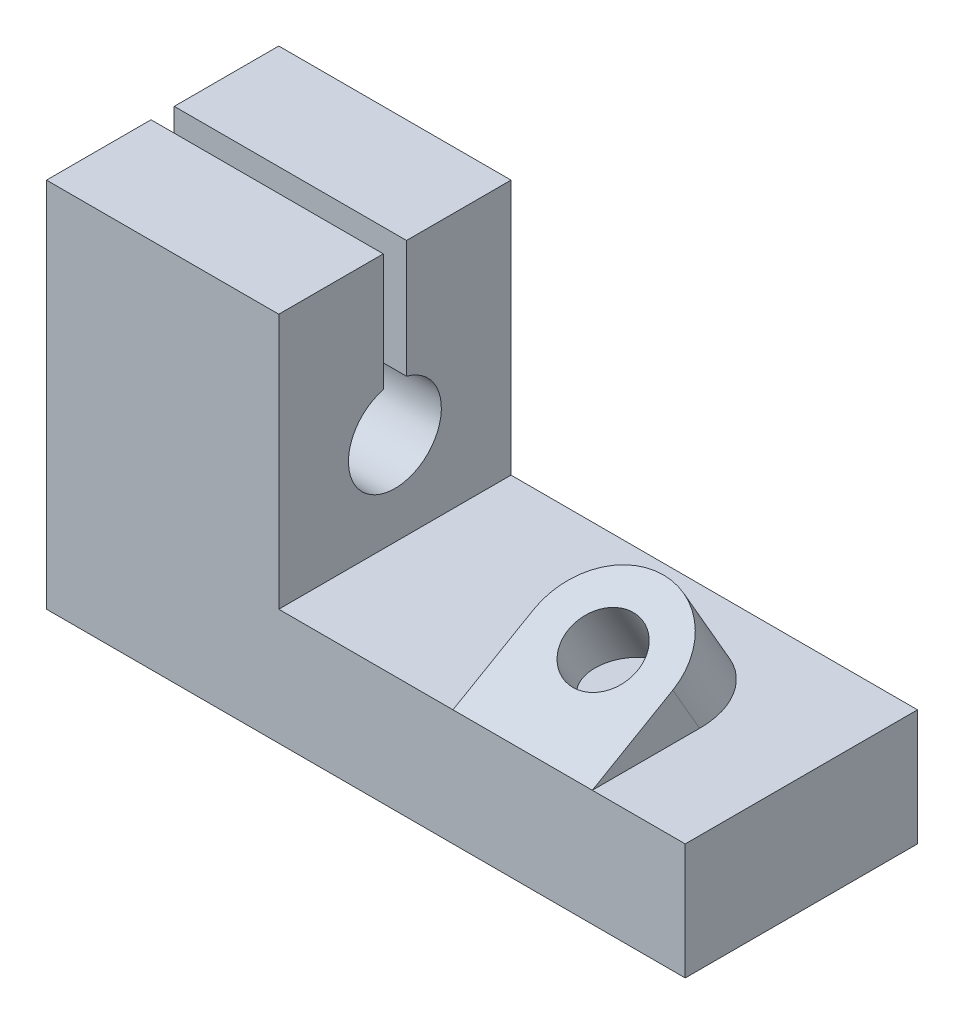
ISO-10303-21;
HEADER;
FILE_DESCRIPTION(('STEP AP214'),'2;1');
FILE_NAME('part.step','',(''),(''),'','','');
FILE_SCHEMA(('AUTOMOTIVE_DESIGN { 1 0 10303 214 1 1 1 1 }'));
ENDSEC;
DATA;
#1=APPLICATION_CONTEXT('core data for automotive mechanical design processes');
#2=APPLICATION_PROTOCOL_DEFINITION('international standard','automotive_design',2000,#1);
#3=PRODUCT_CONTEXT('',#1,'mechanical');
#4=PRODUCT('Part','Part','',(#3));
#5=PRODUCT_RELATED_PRODUCT_CATEGORY('part','',(#4));
#6=PRODUCT_DEFINITION_FORMATION('','',#4);
#7=PRODUCT_DEFINITION_CONTEXT('part definition',#1,'design');
#8=PRODUCT_DEFINITION('design','',#6,#7);
#9=PRODUCT_DEFINITION_SHAPE('','',#8);
#10=(LENGTH_UNIT() NAMED_UNIT(*) SI_UNIT(.MILLI.,.METRE.));
#11=(NAMED_UNIT(*) PLANE_ANGLE_UNIT() SI_UNIT($,.RADIAN.));
#12=(NAMED_UNIT(*) SI_UNIT($,.STERADIAN.) SOLID_ANGLE_UNIT());
#13=UNCERTAINTY_MEASURE_WITH_UNIT(LENGTH_MEASURE(1.E-05),#10,'distance_accuracy_value','');
#14=(GEOMETRIC_REPRESENTATION_CONTEXT(3) GLOBAL_UNCERTAINTY_ASSIGNED_CONTEXT((#13)) GLOBAL_UNIT_ASSIGNED_CONTEXT((#10,
#11,#12)) REPRESENTATION_CONTEXT('',''));
#15=CARTESIAN_POINT('',(0.,0.,0.));
#16=DIRECTION('',(0.,0.,1.));
#17=DIRECTION('',(1.,0.,0.));
#18=AXIS2_PLACEMENT_3D('',#15,#16,#17);
#19=CARTESIAN_POINT('',(0.,32.,10.));
#20=DIRECTION('',(0.,-1.,0.));
#21=DIRECTION('',(0.,0.,-1.));
#22=AXIS2_PLACEMENT_3D('',#19,#20,#21);
#23=PLANE('',#22);
#24=DIRECTION('',(0.,0.,-1.));
#25=VECTOR('',#24,1.);
#26=CARTESIAN_POINT('',(20.,32.,10.));
#27=LINE('',#26,#25);
#28=CARTESIAN_POINT('',(20.,32.,10.));
#29=VERTEX_POINT('',#28);
#30=CARTESIAN_POINT('',(20.,32.,1.));
#31=VERTEX_POINT('',#30);
#32=EDGE_CURVE('E240',#29,#31,#27,.T.);
#33=ORIENTED_EDGE('',*,*,#32,.T.);
#34=DIRECTION('',(1.,0.,0.));
#35=VECTOR('',#34,1.);
#36=CARTESIAN_POINT('',(0.,32.,1.));
#37=LINE('',#36,#35);
#38=CARTESIAN_POINT('',(0.,32.,1.));
#39=VERTEX_POINT('',#38);
#40=EDGE_CURVE('E202',#39,#31,#37,.T.);
#41=ORIENTED_EDGE('',*,*,#40,.F.);
#42=DIRECTION('',(0.,0.,-1.));
#43=VECTOR('',#42,1.);
#44=CARTESIAN_POINT('',(0.,32.,10.));
#45=LINE('',#44,#43);
#46=CARTESIAN_POINT('',(0.,32.,10.));
#47=VERTEX_POINT('',#46);
#48=EDGE_CURVE('E236',#47,#39,#45,.T.);
#49=ORIENTED_EDGE('',*,*,#48,.F.);
#50=DIRECTION('',(-1.,0.,0.));
#51=VECTOR('',#50,1.);
#52=CARTESIAN_POINT('',(0.,32.,10.));
#53=LINE('',#52,#51);
#54=EDGE_CURVE('E220',#29,#47,#53,.T.);
#55=ORIENTED_EDGE('',*,*,#54,.F.);
#56=EDGE_LOOP('',(#33,#41,#49,#55));
#57=FACE_BOUND('',#56,.T.);
#58=ADVANCED_FACE('F51',(#57),#23,.F.);
#59=CARTESIAN_POINT('',(0.,0.,10.));
#60=DIRECTION('',(1.,0.,0.));
#61=DIRECTION('',(0.,0.,-1.));
#62=AXIS2_PLACEMENT_3D('',#59,#60,#61);
#63=PLANE('',#62);
#64=ORIENTED_EDGE('',*,*,#48,.T.);
#65=DIRECTION('',(0.,-1.,0.));
#66=VECTOR('',#65,1.);
#67=CARTESIAN_POINT('',(0.,32.,1.));
#68=LINE('',#67,#66);
#69=CARTESIAN_POINT('',(0.,21.8729833462074,0.999999999999999));
#70=VERTEX_POINT('',#69);
#71=EDGE_CURVE('E190',#39,#70,#68,.T.);
#72=ORIENTED_EDGE('',*,*,#71,.T.);
#73=CARTESIAN_POINT('',(0.,18.,0.));
#74=DIRECTION('',(1.,0.,0.));
#75=DIRECTION('',(0.,1.,0.));
#76=AXIS2_PLACEMENT_3D('',#73,#74,#75);
#77=CIRCLE('',#76,4.);
#78=CARTESIAN_POINT('',(0.,21.8729833462074,-0.999999999999999));
#79=VERTEX_POINT('',#78);
#80=EDGE_CURVE('E183',#70,#79,#77,.T.);
#81=ORIENTED_EDGE('',*,*,#80,.T.);
#82=DIRECTION('',(0.,1.,0.));
#83=VECTOR('',#82,1.);
#84=CARTESIAN_POINT('',(0.,32.,-1.));
#85=LINE('',#84,#83);
#86=CARTESIAN_POINT('',(0.,32.,-1.));
#87=VERTEX_POINT('',#86);
#88=EDGE_CURVE('E186',#79,#87,#85,.T.);
#89=ORIENTED_EDGE('',*,*,#88,.T.);
#90=CARTESIAN_POINT('',(0.,32.,-10.));
#91=VERTEX_POINT('',#90);
#92=EDGE_CURVE('E222',#87,#91,#45,.T.);
#93=ORIENTED_EDGE('',*,*,#92,.T.);
#94=DIRECTION('',(0.,-1.,0.));
#95=VECTOR('',#94,1.);
#96=CARTESIAN_POINT('',(0.,0.,-10.));
#97=LINE('',#96,#95);
#98=CARTESIAN_POINT('',(0.,0.,-10.));
#99=VERTEX_POINT('',#98);
#100=EDGE_CURVE('E201',#91,#99,#97,.T.);
#101=ORIENTED_EDGE('',*,*,#100,.T.);
#102=DIRECTION('',(0.,0.,-1.));
#103=VECTOR('',#102,1.);
#104=CARTESIAN_POINT('',(0.,0.,10.));
#105=LINE('',#104,#103);
#106=CARTESIAN_POINT('',(0.,0.,10.));
#107=VERTEX_POINT('',#106);
#108=EDGE_CURVE('E59',#107,#99,#105,.T.);
#109=ORIENTED_EDGE('',*,*,#108,.F.);
#110=DIRECTION('',(0.,-1.,0.));
#111=VECTOR('',#110,1.);
#112=CARTESIAN_POINT('',(0.,0.,10.));
#113=LINE('',#112,#111);
#114=EDGE_CURVE('E207',#47,#107,#113,.T.);
#115=ORIENTED_EDGE('',*,*,#114,.F.);
#116=EDGE_LOOP('',(#64,#72,#81,#89,#93,#101,#109,#115));
#117=FACE_BOUND('',#116,.T.);
#118=ADVANCED_FACE('F53',(#117),#63,.F.);
#119=CARTESIAN_POINT('',(0.,0.,10.));
#120=DIRECTION('',(0.,1.,0.));
#121=DIRECTION('',(0.,0.,1.));
#122=AXIS2_PLACEMENT_3D('',#119,#120,#121);
#123=PLANE('',#122);
#124=DIRECTION('',(1.,0.,0.));
#125=VECTOR('',#124,1.);
#126=CARTESIAN_POINT('',(0.,0.,-10.));
#127=LINE('',#126,#125);
#128=CARTESIAN_POINT('',(55.,0.,-10.));
#129=VERTEX_POINT('',#128);
#130=EDGE_CURVE('E225',#99,#129,#127,.T.);
#131=ORIENTED_EDGE('',*,*,#130,.T.);
#132=DIRECTION('',(0.,0.,-1.));
#133=VECTOR('',#132,1.);
#134=CARTESIAN_POINT('',(55.,0.,10.));
#135=LINE('',#134,#133);
#136=CARTESIAN_POINT('',(55.,0.,10.));
#137=VERTEX_POINT('',#136);
#138=EDGE_CURVE('E249',#137,#129,#135,.T.);
#139=ORIENTED_EDGE('',*,*,#138,.F.);
#140=DIRECTION('',(1.,0.,0.));
#141=VECTOR('',#140,1.);
#142=CARTESIAN_POINT('',(0.,0.,10.));
#143=LINE('',#142,#141);
#144=EDGE_CURVE('E210',#107,#137,#143,.T.);
#145=ORIENTED_EDGE('',*,*,#144,.F.);
#146=ORIENTED_EDGE('',*,*,#108,.T.);
#147=EDGE_LOOP('',(#131,#139,#145,#146));
#148=FACE_BOUND('',#147,.T.);
#149=ADVANCED_FACE('F254',(#148),#123,.F.);
#150=CARTESIAN_POINT('',(55.,10.,10.));
#151=DIRECTION('',(-1.,0.,0.));
#152=DIRECTION('',(0.,0.,1.));
#153=AXIS2_PLACEMENT_3D('',#150,#151,#152);
#154=PLANE('',#153);
#155=DIRECTION('',(0.,1.,0.));
#156=VECTOR('',#155,1.);
#157=CARTESIAN_POINT('',(55.,10.,-10.));
#158=LINE('',#157,#156);
#159=CARTESIAN_POINT('',(55.,10.,-10.));
#160=VERTEX_POINT('',#159);
#161=EDGE_CURVE('E227',#129,#160,#158,.T.);
#162=ORIENTED_EDGE('',*,*,#161,.T.);
#163=DIRECTION('',(0.,0.,-1.));
#164=VECTOR('',#163,1.);
#165=CARTESIAN_POINT('',(55.,10.,10.));
#166=LINE('',#165,#164);
#167=CARTESIAN_POINT('',(55.,10.,10.));
#168=VERTEX_POINT('',#167);
#169=EDGE_CURVE('E246',#168,#160,#166,.T.);
#170=ORIENTED_EDGE('',*,*,#169,.F.);
#171=DIRECTION('',(0.,1.,0.));
#172=VECTOR('',#171,1.);
#173=CARTESIAN_POINT('',(55.,10.,10.));
#174=LINE('',#173,#172);
#175=EDGE_CURVE('E213',#137,#168,#174,.T.);
#176=ORIENTED_EDGE('',*,*,#175,.F.);
#177=ORIENTED_EDGE('',*,*,#138,.T.);
#178=EDGE_LOOP('',(#162,#170,#176,#177));
#179=FACE_BOUND('',#178,.T.);
#180=ADVANCED_FACE('F268',(#179),#154,.F.);
#181=CARTESIAN_POINT('',(20.,10.,10.));
#182=DIRECTION('',(0.,-1.,0.));
#183=DIRECTION('',(0.,0.,-1.));
#184=AXIS2_PLACEMENT_3D('',#181,#182,#183);
#185=PLANE('',#184);
#186=DIRECTION('',(-1.,0.,0.));
#187=VECTOR('',#186,1.);
#188=CARTESIAN_POINT('',(20.,10.,10.));
#189=LINE('',#188,#187);
#190=CARTESIAN_POINT('',(35.,10.,10.));
#191=VERTEX_POINT('',#190);
#192=CARTESIAN_POINT('',(20.,10.,10.));
#193=VERTEX_POINT('',#192);
#194=EDGE_CURVE('E215',#191,#193,#189,.T.);
#195=ORIENTED_EDGE('',*,*,#194,.F.);
#196=DIRECTION('',(0.,0.,1.));
#197=VECTOR('',#196,1.);
#198=CARTESIAN_POINT('',(35.,9.99999999999091,-288673.217498582));
#199=LINE('',#198,#197);
#200=CARTESIAN_POINT('',(35.,9.99999999996248,0.762395692959217));
#201=VERTEX_POINT('',#200);
#202=EDGE_CURVE('E165',#201,#191,#199,.T.);
#203=ORIENTED_EDGE('',*,*,#202,.F.);
#204=CARTESIAN_POINT('',(41.,9.99999999993406,0.762395692959217));
#205=DIRECTION('',(0.,-1.,0.));
#206=DIRECTION('',(0.,0.,1.));
#207=AXIS2_PLACEMENT_3D('',#204,#205,#206);
#208=ELLIPSE('',#207,6.92820323027551,6.);
#209=CARTESIAN_POINT('',(47.,9.99999999993406,0.762395692959217));
#210=VERTEX_POINT('',#209);
#211=EDGE_CURVE('E158',#210,#201,#208,.F.);
#212=ORIENTED_EDGE('',*,*,#211,.F.);
#213=DIRECTION('',(0.,0.,-1.));
#214=VECTOR('',#213,1.);
#215=CARTESIAN_POINT('',(47.,9.99999999999091,-288673.217498582));
#216=LINE('',#215,#214);
#217=CARTESIAN_POINT('',(47.,10.,10.));
#218=VERTEX_POINT('',#217);
#219=EDGE_CURVE('E147',#218,#210,#216,.T.);
#220=ORIENTED_EDGE('',*,*,#219,.F.);
#221=EDGE_CURVE('E216',#168,#218,#189,.T.);
#222=ORIENTED_EDGE('',*,*,#221,.F.);
#223=ORIENTED_EDGE('',*,*,#169,.T.);
#224=DIRECTION('',(-1.,0.,0.));
#225=VECTOR('',#224,1.);
#226=CARTESIAN_POINT('',(20.,10.,-10.));
#227=LINE('',#226,#225);
#228=CARTESIAN_POINT('',(20.,10.,-10.));
#229=VERTEX_POINT('',#228);
#230=EDGE_CURVE('E229',#160,#229,#227,.T.);
#231=ORIENTED_EDGE('',*,*,#230,.T.);
#232=DIRECTION('',(0.,0.,-1.));
#233=VECTOR('',#232,1.);
#234=CARTESIAN_POINT('',(20.,10.,10.));
#235=LINE('',#234,#233);
#236=EDGE_CURVE('E243',#193,#229,#235,.T.);
#237=ORIENTED_EDGE('',*,*,#236,.F.);
#238=EDGE_LOOP('',(#195,#203,#212,#220,#222,#223,#231,#237));
#239=FACE_BOUND('',#238,.T.);
#240=ADVANCED_FACE('F169',(#239),#185,.F.);
#241=CARTESIAN_POINT('',(20.,32.,10.));
#242=DIRECTION('',(-1.,0.,0.));
#243=DIRECTION('',(0.,-1.,0.));
#244=AXIS2_PLACEMENT_3D('',#241,#242,#243);
#245=PLANE('',#244);
#246=CARTESIAN_POINT('',(20.,18.,0.));
#247=DIRECTION('',(1.,0.,0.));
#248=DIRECTION('',(0.,1.,0.));
#249=AXIS2_PLACEMENT_3D('',#246,#247,#248);
#250=CIRCLE('',#249,4.);
#251=CARTESIAN_POINT('',(20.,21.8729833462074,0.999999999999999));
#252=VERTEX_POINT('',#251);
#253=CARTESIAN_POINT('',(20.,21.8729833462074,-0.999999999999999));
#254=VERTEX_POINT('',#253);
#255=EDGE_CURVE('E178',#252,#254,#250,.T.);
#256=ORIENTED_EDGE('',*,*,#255,.F.);
#257=DIRECTION('',(0.,-1.,0.));
#258=VECTOR('',#257,1.);
#259=CARTESIAN_POINT('',(20.,32.,1.));
#260=LINE('',#259,#258);
#261=EDGE_CURVE('E187',#31,#252,#260,.T.);
#262=ORIENTED_EDGE('',*,*,#261,.F.);
#263=ORIENTED_EDGE('',*,*,#32,.F.);
#264=DIRECTION('',(0.,1.,0.));
#265=VECTOR('',#264,1.);
#266=CARTESIAN_POINT('',(20.,32.,10.));
#267=LINE('',#266,#265);
#268=EDGE_CURVE('E218',#193,#29,#267,.T.);
#269=ORIENTED_EDGE('',*,*,#268,.F.);
#270=ORIENTED_EDGE('',*,*,#236,.T.);
#271=DIRECTION('',(0.,1.,0.));
#272=VECTOR('',#271,1.);
#273=CARTESIAN_POINT('',(20.,32.,-10.));
#274=LINE('',#273,#272);
#275=CARTESIAN_POINT('',(20.,32.,-10.));
#276=VERTEX_POINT('',#275);
#277=EDGE_CURVE('E231',#229,#276,#274,.T.);
#278=ORIENTED_EDGE('',*,*,#277,.T.);
#279=CARTESIAN_POINT('',(20.,32.,-0.999999999999999));
#280=VERTEX_POINT('',#279);
#281=EDGE_CURVE('E239',#280,#276,#27,.T.);
#282=ORIENTED_EDGE('',*,*,#281,.F.);
#283=DIRECTION('',(0.,1.,0.));
#284=VECTOR('',#283,1.);
#285=CARTESIAN_POINT('',(20.,32.,-1.));
#286=LINE('',#285,#284);
#287=EDGE_CURVE('E74',#254,#280,#286,.T.);
#288=ORIENTED_EDGE('',*,*,#287,.F.);
#289=EDGE_LOOP('',(#256,#262,#263,#269,#270,#278,#282,#288));
#290=FACE_BOUND('',#289,.T.);
#291=ADVANCED_FACE('F284',(#290),#245,.F.);
#292=ORIENTED_EDGE('',*,*,#92,.F.);
#293=DIRECTION('',(1.,0.,0.));
#294=VECTOR('',#293,1.);
#295=CARTESIAN_POINT('',(0.,32.,-1.));
#296=LINE('',#295,#294);
#297=EDGE_CURVE('E204',#87,#280,#296,.T.);
#298=ORIENTED_EDGE('',*,*,#297,.T.);
#299=ORIENTED_EDGE('',*,*,#281,.T.);
#300=DIRECTION('',(-1.,0.,0.));
#301=VECTOR('',#300,1.);
#302=CARTESIAN_POINT('',(0.,32.,-10.));
#303=LINE('',#302,#301);
#304=EDGE_CURVE('E211',#276,#91,#303,.T.);
#305=ORIENTED_EDGE('',*,*,#304,.T.);
#306=EDGE_LOOP('',(#292,#298,#299,#305));
#307=FACE_BOUND('',#306,.T.);
#308=ADVANCED_FACE('F292',(#307),#23,.F.);
#309=CARTESIAN_POINT('',(0.,0.,10.));
#310=DIRECTION('',(0.,0.,-1.));
#311=DIRECTION('',(-1.,0.,0.));
#312=AXIS2_PLACEMENT_3D('',#309,#310,#311);
#313=PLANE('',#312);
#314=ORIENTED_EDGE('',*,*,#114,.T.);
#315=ORIENTED_EDGE('',*,*,#144,.T.);
#316=ORIENTED_EDGE('',*,*,#175,.T.);
#317=ORIENTED_EDGE('',*,*,#221,.T.);
#318=DIRECTION('',(1.,0.,0.));
#319=VECTOR('',#318,1.);
#320=CARTESIAN_POINT('',(47.,10.,10.));
#321=LINE('',#320,#319);
#322=EDGE_CURVE('E174',#191,#218,#321,.T.);
#323=ORIENTED_EDGE('',*,*,#322,.F.);
#324=ORIENTED_EDGE('',*,*,#194,.T.);
#325=ORIENTED_EDGE('',*,*,#268,.T.);
#326=ORIENTED_EDGE('',*,*,#54,.T.);
#327=EDGE_LOOP('',(#314,#315,#316,#317,#323,#324,#325,#326));
#328=FACE_BOUND('',#327,.T.);
#329=ADVANCED_FACE('F273',(#328),#313,.F.);
#330=CARTESIAN_POINT('',(0.,0.,-10.));
#331=DIRECTION('',(0.,0.,-1.));
#332=DIRECTION('',(-1.,0.,0.));
#333=AXIS2_PLACEMENT_3D('',#330,#331,#332);
#334=PLANE('',#333);
#335=ORIENTED_EDGE('',*,*,#100,.F.);
#336=ORIENTED_EDGE('',*,*,#304,.F.);
#337=ORIENTED_EDGE('',*,*,#277,.F.);
#338=ORIENTED_EDGE('',*,*,#230,.F.);
#339=ORIENTED_EDGE('',*,*,#161,.F.);
#340=ORIENTED_EDGE('',*,*,#130,.F.);
#341=EDGE_LOOP('',(#335,#336,#337,#338,#339,#340));
#342=FACE_BOUND('',#341,.T.);
#343=ADVANCED_FACE('F262',(#342),#334,.T.);
#344=CARTESIAN_POINT('',(0.,18.,0.));
#345=DIRECTION('',(1.,0.,0.));
#346=DIRECTION('',(0.,1.,0.));
#347=AXIS2_PLACEMENT_3D('',#344,#345,#346);
#348=CYLINDRICAL_SURFACE('',#347,4.);
#349=ORIENTED_EDGE('',*,*,#255,.T.);
#350=DIRECTION('',(1.,0.,0.));
#351=VECTOR('',#350,1.);
#352=CARTESIAN_POINT('',(0.,21.8729833462074,-0.999999999999999));
#353=LINE('',#352,#351);
#354=EDGE_CURVE('E193',#79,#254,#353,.T.);
#355=ORIENTED_EDGE('',*,*,#354,.F.);
#356=ORIENTED_EDGE('',*,*,#80,.F.);
#357=DIRECTION('',(1.,0.,0.));
#358=VECTOR('',#357,1.);
#359=CARTESIAN_POINT('',(0.,21.8729833462074,0.999999999999999));
#360=LINE('',#359,#358);
#361=EDGE_CURVE('E199',#70,#252,#360,.T.);
#362=ORIENTED_EDGE('',*,*,#361,.T.);
#363=EDGE_LOOP('',(#349,#355,#356,#362));
#364=FACE_BOUND('',#363,.T.);
#365=ADVANCED_FACE('F288',(#364),#348,.F.);
#366=CARTESIAN_POINT('',(0.,32.,1.));
#367=DIRECTION('',(0.,0.,1.));
#368=DIRECTION('',(0.,-1.,0.));
#369=AXIS2_PLACEMENT_3D('',#366,#367,#368);
#370=PLANE('',#369);
#371=ORIENTED_EDGE('',*,*,#261,.T.);
#372=ORIENTED_EDGE('',*,*,#361,.F.);
#373=ORIENTED_EDGE('',*,*,#71,.F.);
#374=ORIENTED_EDGE('',*,*,#40,.T.);
#375=EDGE_LOOP('',(#371,#372,#373,#374));
#376=FACE_BOUND('',#375,.T.);
#377=ADVANCED_FACE('F281',(#376),#370,.F.);
#378=CARTESIAN_POINT('',(0.,32.,-1.));
#379=DIRECTION('',(0.,0.,-1.));
#380=DIRECTION('',(0.,1.,0.));
#381=AXIS2_PLACEMENT_3D('',#378,#379,#380);
#382=PLANE('',#381);
#383=ORIENTED_EDGE('',*,*,#287,.T.);
#384=ORIENTED_EDGE('',*,*,#297,.F.);
#385=ORIENTED_EDGE('',*,*,#88,.F.);
#386=ORIENTED_EDGE('',*,*,#354,.T.);
#387=EDGE_LOOP('',(#383,#384,#385,#386));
#388=FACE_BOUND('',#387,.T.);
#389=ADVANCED_FACE('F293',(#388),#382,.F.);
#390=CARTESIAN_POINT('',(35.,-500004.,-288673.217498582));
#391=DIRECTION('',(-1.,0.,0.));
#392=DIRECTION('',(0.,0.,1.));
#393=AXIS2_PLACEMENT_3D('',#390,#391,#392);
#394=PLANE('',#393);
#395=DIRECTION('',(0.,0.866025403784438,0.500000000000001));
#396=VECTOR('',#395,1.);
#397=CARTESIAN_POINT('',(35.,-500000.,-288680.145701813));
#398=LINE('',#397,#396);
#399=CARTESIAN_POINT('',(35.,14.,3.0717967697245));
#400=VERTEX_POINT('',#399);
#401=EDGE_CURVE('E164',#201,#400,#398,.T.);
#402=ORIENTED_EDGE('',*,*,#401,.F.);
#403=ORIENTED_EDGE('',*,*,#202,.T.);
#404=DIRECTION('',(0.,-0.500000000000001,0.866025403784438));
#405=VECTOR('',#404,1.);
#406=CARTESIAN_POINT('',(35.,10.,10.));
#407=LINE('',#406,#405);
#408=EDGE_CURVE('E66',#400,#191,#407,.T.);
#409=ORIENTED_EDGE('',*,*,#408,.F.);
#410=EDGE_LOOP('',(#402,#403,#409));
#411=FACE_BOUND('',#410,.T.);
#412=ADVANCED_FACE('F295',(#411),#394,.T.);
#413=CARTESIAN_POINT('',(41.,-500000.,-288680.145701813));
#414=DIRECTION('',(0.,0.866025403784438,0.500000000000001));
#415=DIRECTION('',(0.,-0.500000000000001,0.866025403784438));
#416=AXIS2_PLACEMENT_3D('',#413,#414,#415);
#417=CYLINDRICAL_SURFACE('',#416,6.);
#418=DIRECTION('',(0.,0.866025403784438,0.500000000000001));
#419=VECTOR('',#418,1.);
#420=CARTESIAN_POINT('',(47.,-500000.,-288680.145701813));
#421=LINE('',#420,#419);
#422=CARTESIAN_POINT('',(47.,14.,3.07179676972449));
#423=VERTEX_POINT('',#422);
#424=EDGE_CURVE('E150',#210,#423,#421,.T.);
#425=ORIENTED_EDGE('',*,*,#424,.F.);
#426=ORIENTED_EDGE('',*,*,#211,.T.);
#427=ORIENTED_EDGE('',*,*,#401,.T.);
#428=CARTESIAN_POINT('',(41.,14.,3.0717967697245));
#429=DIRECTION('',(0.,0.866025403784438,0.500000000000001));
#430=DIRECTION('',(0.,-0.500000000000001,0.866025403784438));
#431=AXIS2_PLACEMENT_3D('',#428,#429,#430);
#432=CIRCLE('',#431,6.);
#433=EDGE_CURVE('E163',#423,#400,#432,.T.);
#434=ORIENTED_EDGE('',*,*,#433,.F.);
#435=EDGE_LOOP('',(#425,#426,#427,#434));
#436=FACE_BOUND('',#435,.T.);
#437=ADVANCED_FACE('F161',(#436),#417,.T.);
#438=CARTESIAN_POINT('',(47.,-500004.,-288673.217498582));
#439=DIRECTION('',(1.,0.,0.));
#440=DIRECTION('',(0.,0.,-1.));
#441=AXIS2_PLACEMENT_3D('',#438,#439,#440);
#442=PLANE('',#441);
#443=DIRECTION('',(0.,0.500000000000001,-0.866025403784438));
#444=VECTOR('',#443,1.);
#445=CARTESIAN_POINT('',(47.,10.,10.));
#446=LINE('',#445,#444);
#447=EDGE_CURVE('E153',#218,#423,#446,.T.);
#448=ORIENTED_EDGE('',*,*,#447,.F.);
#449=ORIENTED_EDGE('',*,*,#219,.T.);
#450=ORIENTED_EDGE('',*,*,#424,.T.);
#451=EDGE_LOOP('',(#448,#449,#450));
#452=FACE_BOUND('',#451,.T.);
#453=ADVANCED_FACE('F149',(#452),#442,.T.);
#454=CARTESIAN_POINT('',(41.,-500000.,-288680.145701813));
#455=DIRECTION('',(0.,0.866025403784438,0.500000000000001));
#456=DIRECTION('',(0.,-0.500000000000001,0.866025403784438));
#457=AXIS2_PLACEMENT_3D('',#454,#455,#456);
#458=CYLINDRICAL_SURFACE('',#457,3.);
#459=CARTESIAN_POINT('',(41.,14.,3.0717967697245));
#460=DIRECTION('',(0.,0.866025403784438,0.500000000000001));
#461=DIRECTION('',(0.,-0.500000000000001,0.866025403784438));
#462=AXIS2_PLACEMENT_3D('',#459,#460,#461);
#463=CIRCLE('',#462,3.);
#464=CARTESIAN_POINT('',(41.,12.5,5.66987298107781));
#465=VERTEX_POINT('',#464);
#466=EDGE_CURVE('E176',#465,#465,#463,.T.);
#467=ORIENTED_EDGE('',*,*,#466,.T.);
#468=EDGE_LOOP('',(#467));
#469=FACE_BOUND('',#468,.T.);
#470=CARTESIAN_POINT('',(41.,9.99999999993406,0.762395692959217));
#471=DIRECTION('',(0.,-1.,0.));
#472=DIRECTION('',(0.,0.,1.));
#473=AXIS2_PLACEMENT_3D('',#470,#471,#472);
#474=ELLIPSE('',#473,3.46410161513776,3.);
#475=CARTESIAN_POINT('',(41.,9.99999999993406,4.22649730809698));
#476=VERTEX_POINT('',#475);
#477=EDGE_CURVE('E12',#476,#476,#474,.T.);
#478=ORIENTED_EDGE('',*,*,#477,.T.);
#479=EDGE_LOOP('',(#478));
#480=FACE_BOUND('',#479,.T.);
#481=ADVANCED_FACE('F308',(#469,#480),#458,.F.);
#482=CARTESIAN_POINT('',(41.,14.,3.0717967697245));
#483=DIRECTION('',(0.,0.866025403784438,0.500000000000001));
#484=DIRECTION('',(0.,-0.500000000000001,0.866025403784438));
#485=AXIS2_PLACEMENT_3D('',#482,#483,#484);
#486=PLANE('',#485);
#487=ORIENTED_EDGE('',*,*,#466,.F.);
#488=EDGE_LOOP('',(#487));
#489=FACE_BOUND('',#488,.T.);
#490=ORIENTED_EDGE('',*,*,#447,.T.);
#491=ORIENTED_EDGE('',*,*,#433,.T.);
#492=ORIENTED_EDGE('',*,*,#408,.T.);
#493=ORIENTED_EDGE('',*,*,#322,.T.);
#494=EDGE_LOOP('',(#490,#491,#492,#493));
#495=FACE_BOUND('',#494,.T.);
#496=ADVANCED_FACE('F297',(#489,#495),#486,.T.);
#497=ORIENTED_EDGE('',*,*,#477,.F.);
#498=EDGE_LOOP('',(#497));
#499=FACE_BOUND('',#498,.T.);
#500=ADVANCED_FACE('F304',(#499),#185,.F.);
#501=CLOSED_SHELL('',(#58,#118,#149,#180,#240,#291,#308,#329,#343,#365,#377,#389,#412,#437,#453,
#481,#496,#500));
#502=MANIFOLD_SOLID_BREP('B2',#501);
#503=ADVANCED_BREP_SHAPE_REPRESENTATION('',(#18,#502),#14);
#504=SHAPE_DEFINITION_REPRESENTATION(#9,#503);
ENDSEC;
END-ISO-10303-21;
